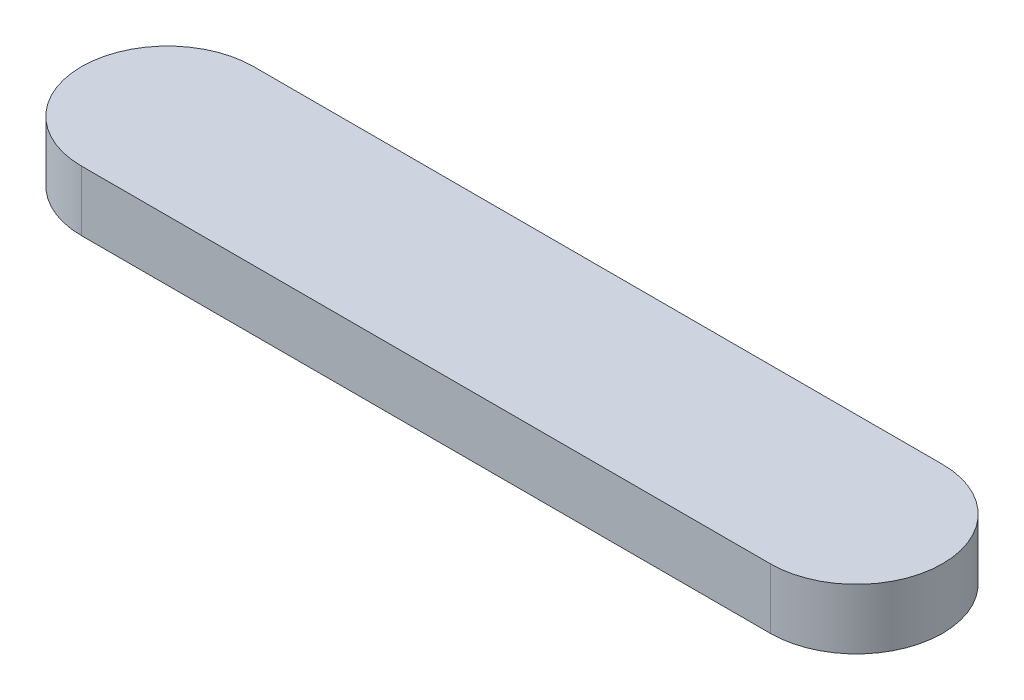
ISO-10303-21;
HEADER;
FILE_DESCRIPTION(('STEP AP214'),'2;1');
FILE_NAME('part.step','',(''),(''),'','','');
FILE_SCHEMA(('AUTOMOTIVE_DESIGN { 1 0 10303 214 1 1 1 1 }'));
ENDSEC;
DATA;
#1=APPLICATION_CONTEXT('core data for automotive mechanical design processes');
#2=APPLICATION_PROTOCOL_DEFINITION('international standard','automotive_design',2000,#1);
#3=PRODUCT_CONTEXT('',#1,'mechanical');
#4=PRODUCT('Part','Part','',(#3));
#5=PRODUCT_RELATED_PRODUCT_CATEGORY('part','',(#4));
#6=PRODUCT_DEFINITION_FORMATION('','',#4);
#7=PRODUCT_DEFINITION_CONTEXT('part definition',#1,'design');
#8=PRODUCT_DEFINITION('design','',#6,#7);
#9=PRODUCT_DEFINITION_SHAPE('','',#8);
#10=(LENGTH_UNIT() NAMED_UNIT(*) SI_UNIT(.MILLI.,.METRE.));
#11=(NAMED_UNIT(*) PLANE_ANGLE_UNIT() SI_UNIT($,.RADIAN.));
#12=(NAMED_UNIT(*) SI_UNIT($,.STERADIAN.) SOLID_ANGLE_UNIT());
#13=UNCERTAINTY_MEASURE_WITH_UNIT(LENGTH_MEASURE(1.E-05),#10,'distance_accuracy_value','');
#14=(GEOMETRIC_REPRESENTATION_CONTEXT(3) GLOBAL_UNCERTAINTY_ASSIGNED_CONTEXT((#13)) GLOBAL_UNIT_ASSIGNED_CONTEXT((#10,
#11,#12)) REPRESENTATION_CONTEXT('',''));
#15=CARTESIAN_POINT('',(0.,0.,0.));
#16=DIRECTION('',(0.,0.,1.));
#17=DIRECTION('',(1.,0.,0.));
#18=AXIS2_PLACEMENT_3D('',#15,#16,#17);
#19=CARTESIAN_POINT('',(0.,70.,0.));
#20=DIRECTION('',(0.,-1.,0.));
#21=DIRECTION('',(0.,0.,-1.));
#22=AXIS2_PLACEMENT_3D('',#19,#20,#21);
#23=CYLINDRICAL_SURFACE('',#22,100.);
#24=CARTESIAN_POINT('',(0.,0.,0.));
#25=DIRECTION('',(0.,1.,0.));
#26=DIRECTION('',(0.,0.,1.));
#27=AXIS2_PLACEMENT_3D('',#24,#25,#26);
#28=CIRCLE('',#27,100.);
#29=CARTESIAN_POINT('',(0.,0.,-100.));
#30=VERTEX_POINT('',#29);
#31=CARTESIAN_POINT('',(0.,0.,100.));
#32=VERTEX_POINT('',#31);
#33=EDGE_CURVE('E111',#30,#32,#28,.T.);
#34=ORIENTED_EDGE('',*,*,#33,.T.);
#35=DIRECTION('',(0.,-1.,0.));
#36=VECTOR('',#35,1.);
#37=CARTESIAN_POINT('',(0.,70.,100.));
#38=LINE('',#37,#36);
#39=CARTESIAN_POINT('',(0.,70.,100.));
#40=VERTEX_POINT('',#39);
#41=EDGE_CURVE('E100',#40,#32,#38,.T.);
#42=ORIENTED_EDGE('',*,*,#41,.F.);
#43=CARTESIAN_POINT('',(0.,70.,0.));
#44=DIRECTION('',(0.,1.,0.));
#45=DIRECTION('',(0.,0.,1.));
#46=AXIS2_PLACEMENT_3D('',#43,#44,#45);
#47=CIRCLE('',#46,100.);
#48=CARTESIAN_POINT('',(0.,70.,-100.));
#49=VERTEX_POINT('',#48);
#50=EDGE_CURVE('E92',#49,#40,#47,.T.);
#51=ORIENTED_EDGE('',*,*,#50,.F.);
#52=DIRECTION('',(0.,-1.,0.));
#53=VECTOR('',#52,1.);
#54=CARTESIAN_POINT('',(0.,70.,-100.));
#55=LINE('',#54,#53);
#56=EDGE_CURVE('E107',#49,#30,#55,.T.);
#57=ORIENTED_EDGE('',*,*,#56,.T.);
#58=EDGE_LOOP('',(#34,#42,#51,#57));
#59=FACE_BOUND('',#58,.T.);
#60=ADVANCED_FACE('F39',(#59),#23,.T.);
#61=CARTESIAN_POINT('',(0.,70.,100.));
#62=DIRECTION('',(0.,0.,-1.));
#63=DIRECTION('',(-1.,0.,0.));
#64=AXIS2_PLACEMENT_3D('',#61,#62,#63);
#65=PLANE('',#64);
#66=DIRECTION('',(1.,0.,0.));
#67=VECTOR('',#66,1.);
#68=CARTESIAN_POINT('',(0.,0.,100.));
#69=LINE('',#68,#67);
#70=CARTESIAN_POINT('',(800.,0.,100.));
#71=VERTEX_POINT('',#70);
#72=EDGE_CURVE('E98',#32,#71,#69,.T.);
#73=ORIENTED_EDGE('',*,*,#72,.T.);
#74=DIRECTION('',(0.,-1.,0.));
#75=VECTOR('',#74,1.);
#76=CARTESIAN_POINT('',(800.,70.,100.));
#77=LINE('',#76,#75);
#78=CARTESIAN_POINT('',(800.,70.,100.));
#79=VERTEX_POINT('',#78);
#80=EDGE_CURVE('E96',#79,#71,#77,.T.);
#81=ORIENTED_EDGE('',*,*,#80,.F.);
#82=DIRECTION('',(1.,0.,0.));
#83=VECTOR('',#82,1.);
#84=CARTESIAN_POINT('',(0.,70.,100.));
#85=LINE('',#84,#83);
#86=EDGE_CURVE('E87',#40,#79,#85,.T.);
#87=ORIENTED_EDGE('',*,*,#86,.F.);
#88=ORIENTED_EDGE('',*,*,#41,.T.);
#89=EDGE_LOOP('',(#73,#81,#87,#88));
#90=FACE_BOUND('',#89,.T.);
#91=ADVANCED_FACE('F97',(#90),#65,.F.);
#92=CARTESIAN_POINT('',(800.,70.,0.));
#93=DIRECTION('',(0.,-1.,0.));
#94=DIRECTION('',(0.,0.,-1.));
#95=AXIS2_PLACEMENT_3D('',#92,#93,#94);
#96=CYLINDRICAL_SURFACE('',#95,100.);
#97=CARTESIAN_POINT('',(800.,0.,0.));
#98=DIRECTION('',(0.,1.,0.));
#99=DIRECTION('',(0.,0.,1.));
#100=AXIS2_PLACEMENT_3D('',#97,#98,#99);
#101=CIRCLE('',#100,100.);
#102=CARTESIAN_POINT('',(800.,0.,-100.));
#103=VERTEX_POINT('',#102);
#104=EDGE_CURVE('E73',#71,#103,#101,.T.);
#105=ORIENTED_EDGE('',*,*,#104,.T.);
#106=DIRECTION('',(0.,-1.,0.));
#107=VECTOR('',#106,1.);
#108=CARTESIAN_POINT('',(800.,70.,-100.));
#109=LINE('',#108,#107);
#110=CARTESIAN_POINT('',(800.,70.,-100.));
#111=VERTEX_POINT('',#110);
#112=EDGE_CURVE('E101',#111,#103,#109,.T.);
#113=ORIENTED_EDGE('',*,*,#112,.F.);
#114=CARTESIAN_POINT('',(800.,70.,0.));
#115=DIRECTION('',(0.,1.,0.));
#116=DIRECTION('',(0.,0.,1.));
#117=AXIS2_PLACEMENT_3D('',#114,#115,#116);
#118=CIRCLE('',#117,100.);
#119=EDGE_CURVE('E90',#79,#111,#118,.T.);
#120=ORIENTED_EDGE('',*,*,#119,.F.);
#121=ORIENTED_EDGE('',*,*,#80,.T.);
#122=EDGE_LOOP('',(#105,#113,#120,#121));
#123=FACE_BOUND('',#122,.T.);
#124=ADVANCED_FACE('F103',(#123),#96,.T.);
#125=CARTESIAN_POINT('',(0.,70.,-100.));
#126=DIRECTION('',(0.,0.,1.));
#127=DIRECTION('',(1.,0.,0.));
#128=AXIS2_PLACEMENT_3D('',#125,#126,#127);
#129=PLANE('',#128);
#130=DIRECTION('',(-1.,0.,0.));
#131=VECTOR('',#130,1.);
#132=CARTESIAN_POINT('',(0.,0.,-100.));
#133=LINE('',#132,#131);
#134=EDGE_CURVE('E79',#103,#30,#133,.T.);
#135=ORIENTED_EDGE('',*,*,#134,.T.);
#136=ORIENTED_EDGE('',*,*,#56,.F.);
#137=DIRECTION('',(-1.,0.,0.));
#138=VECTOR('',#137,1.);
#139=CARTESIAN_POINT('',(0.,70.,-100.));
#140=LINE('',#139,#138);
#141=EDGE_CURVE('E56',#111,#49,#140,.T.);
#142=ORIENTED_EDGE('',*,*,#141,.F.);
#143=ORIENTED_EDGE('',*,*,#112,.T.);
#144=EDGE_LOOP('',(#135,#136,#142,#143));
#145=FACE_BOUND('',#144,.T.);
#146=ADVANCED_FACE('F140',(#145),#129,.F.);
#147=CARTESIAN_POINT('',(0.,70.,0.));
#148=DIRECTION('',(0.,1.,0.));
#149=DIRECTION('',(0.,0.,1.));
#150=AXIS2_PLACEMENT_3D('',#147,#148,#149);
#151=PLANE('',#150);
#152=ORIENTED_EDGE('',*,*,#50,.T.);
#153=ORIENTED_EDGE('',*,*,#86,.T.);
#154=ORIENTED_EDGE('',*,*,#119,.T.);
#155=ORIENTED_EDGE('',*,*,#141,.T.);
#156=EDGE_LOOP('',(#152,#153,#154,#155));
#157=FACE_BOUND('',#156,.T.);
#158=ADVANCED_FACE('F88',(#157),#151,.T.);
#159=CARTESIAN_POINT('',(0.,0.,0.));
#160=DIRECTION('',(0.,1.,0.));
#161=DIRECTION('',(0.,0.,1.));
#162=AXIS2_PLACEMENT_3D('',#159,#160,#161);
#163=PLANE('',#162);
#164=CARTESIAN_POINT('',(800.,0.,0.));
#165=DIRECTION('',(0.,1.,0.));
#166=DIRECTION('',(0.,0.,1.));
#167=AXIS2_PLACEMENT_3D('',#164,#165,#166);
#168=CIRCLE('',#167,9.99999999999998);
#169=CARTESIAN_POINT('',(800.,0.,9.99999999999998));
#170=VERTEX_POINT('',#169);
#171=EDGE_CURVE('E11',#170,#170,#168,.F.);
#172=ORIENTED_EDGE('',*,*,#171,.F.);
#173=EDGE_LOOP('',(#172));
#174=FACE_BOUND('',#173,.T.);
#175=CARTESIAN_POINT('',(0.,0.,0.));
#176=DIRECTION('',(0.,1.,0.));
#177=DIRECTION('',(0.,0.,1.));
#178=AXIS2_PLACEMENT_3D('',#175,#176,#177);
#179=CIRCLE('',#178,10.);
#180=CARTESIAN_POINT('',(0.,0.,10.));
#181=VERTEX_POINT('',#180);
#182=EDGE_CURVE('E48',#181,#181,#179,.F.);
#183=ORIENTED_EDGE('',*,*,#182,.F.);
#184=EDGE_LOOP('',(#183));
#185=FACE_BOUND('',#184,.T.);
#186=ORIENTED_EDGE('',*,*,#33,.F.);
#187=ORIENTED_EDGE('',*,*,#134,.F.);
#188=ORIENTED_EDGE('',*,*,#104,.F.);
#189=ORIENTED_EDGE('',*,*,#72,.F.);
#190=EDGE_LOOP('',(#186,#187,#188,#189));
#191=FACE_BOUND('',#190,.T.);
#192=ADVANCED_FACE('F133',(#174,#185,#191),#163,.F.);
#193=CARTESIAN_POINT('',(0.,-20.,0.));
#194=DIRECTION('',(0.,1.,0.));
#195=DIRECTION('',(0.,0.,1.));
#196=AXIS2_PLACEMENT_3D('',#193,#194,#195);
#197=CYLINDRICAL_SURFACE('',#196,10.);
#198=CARTESIAN_POINT('',(0.,-20.,0.));
#199=DIRECTION('',(0.,-1.,0.));
#200=DIRECTION('',(0.,0.,-1.));
#201=AXIS2_PLACEMENT_3D('',#198,#199,#200);
#202=CIRCLE('',#201,10.);
#203=CARTESIAN_POINT('',(0.,-20.,-10.));
#204=VERTEX_POINT('',#203);
#205=EDGE_CURVE('E115',#204,#204,#202,.T.);
#206=ORIENTED_EDGE('',*,*,#205,.F.);
#207=EDGE_LOOP('',(#206));
#208=FACE_BOUND('',#207,.T.);
#209=ORIENTED_EDGE('',*,*,#182,.T.);
#210=EDGE_LOOP('',(#209));
#211=FACE_BOUND('',#210,.T.);
#212=ADVANCED_FACE('F131',(#208,#211),#197,.T.);
#213=CARTESIAN_POINT('',(0.,-20.,0.));
#214=DIRECTION('',(0.,-1.,0.));
#215=DIRECTION('',(0.,0.,-1.));
#216=AXIS2_PLACEMENT_3D('',#213,#214,#215);
#217=PLANE('',#216);
#218=ORIENTED_EDGE('',*,*,#205,.T.);
#219=EDGE_LOOP('',(#218));
#220=FACE_BOUND('',#219,.T.);
#221=ADVANCED_FACE('F179',(#220),#217,.T.);
#222=CARTESIAN_POINT('',(800.,-20.,0.));
#223=DIRECTION('',(0.,1.,0.));
#224=DIRECTION('',(0.,0.,1.));
#225=AXIS2_PLACEMENT_3D('',#222,#223,#224);
#226=CYLINDRICAL_SURFACE('',#225,9.99999999999998);
#227=CARTESIAN_POINT('',(800.,-20.,0.));
#228=DIRECTION('',(0.,-1.,0.));
#229=DIRECTION('',(0.,0.,-1.));
#230=AXIS2_PLACEMENT_3D('',#227,#228,#229);
#231=CIRCLE('',#230,9.99999999999998);
#232=CARTESIAN_POINT('',(800.,-20.,-9.99999999999998));
#233=VERTEX_POINT('',#232);
#234=EDGE_CURVE('E220',#233,#233,#231,.T.);
#235=ORIENTED_EDGE('',*,*,#234,.F.);
#236=EDGE_LOOP('',(#235));
#237=FACE_BOUND('',#236,.T.);
#238=ORIENTED_EDGE('',*,*,#171,.T.);
#239=EDGE_LOOP('',(#238));
#240=FACE_BOUND('',#239,.T.);
#241=ADVANCED_FACE('F189',(#237,#240),#226,.T.);
#242=CARTESIAN_POINT('',(800.,-20.,0.));
#243=DIRECTION('',(0.,-1.,0.));
#244=DIRECTION('',(0.,0.,-1.));
#245=AXIS2_PLACEMENT_3D('',#242,#243,#244);
#246=PLANE('',#245);
#247=ORIENTED_EDGE('',*,*,#234,.T.);
#248=EDGE_LOOP('',(#247));
#249=FACE_BOUND('',#248,.T.);
#250=ADVANCED_FACE('F204',(#249),#246,.T.);
#251=CLOSED_SHELL('',(#60,#91,#124,#146,#158,#192,#212,#221,#241,#250));
#252=MANIFOLD_SOLID_BREP('B2',#251);
#253=ADVANCED_BREP_SHAPE_REPRESENTATION('',(#18,#252),#14);
#254=SHAPE_DEFINITION_REPRESENTATION(#9,#253);
ENDSEC;
END-ISO-10303-21;
